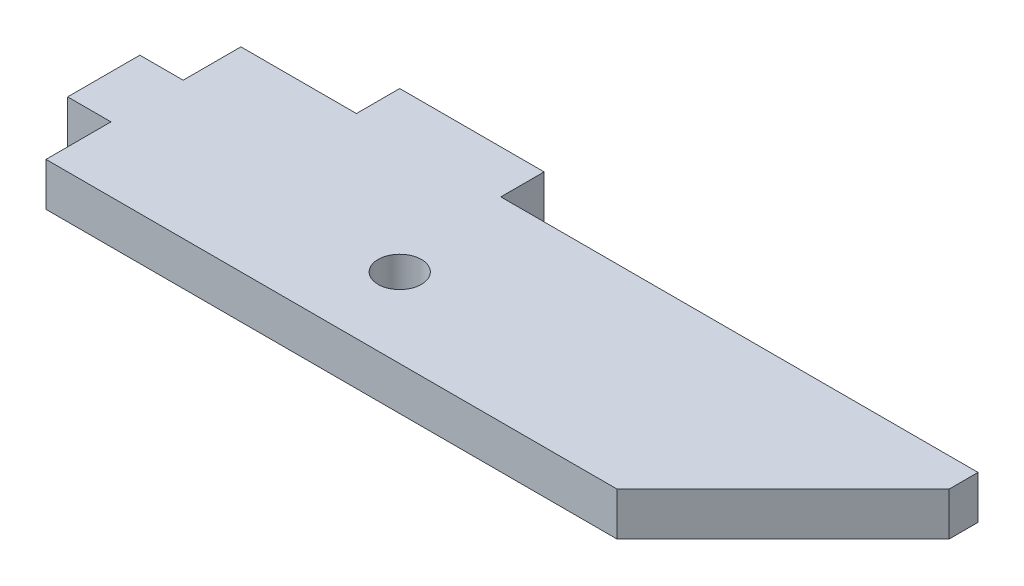
ISO-10303-21;
HEADER;
FILE_DESCRIPTION(('STEP AP214'),'2;1');
FILE_NAME('part.step','',(''),(''),'','','');
FILE_SCHEMA(('AUTOMOTIVE_DESIGN { 1 0 10303 214 1 1 1 1 }'));
ENDSEC;
DATA;
#1=APPLICATION_CONTEXT('core data for automotive mechanical design processes');
#2=APPLICATION_PROTOCOL_DEFINITION('international standard','automotive_design',2000,#1);
#3=PRODUCT_CONTEXT('',#1,'mechanical');
#4=PRODUCT('Part','Part','',(#3));
#5=PRODUCT_RELATED_PRODUCT_CATEGORY('part','',(#4));
#6=PRODUCT_DEFINITION_FORMATION('','',#4);
#7=PRODUCT_DEFINITION_CONTEXT('part definition',#1,'design');
#8=PRODUCT_DEFINITION('design','',#6,#7);
#9=PRODUCT_DEFINITION_SHAPE('','',#8);
#10=(LENGTH_UNIT() NAMED_UNIT(*) SI_UNIT(.MILLI.,.METRE.));
#11=(NAMED_UNIT(*) PLANE_ANGLE_UNIT() SI_UNIT($,.RADIAN.));
#12=(NAMED_UNIT(*) SI_UNIT($,.STERADIAN.) SOLID_ANGLE_UNIT());
#13=UNCERTAINTY_MEASURE_WITH_UNIT(LENGTH_MEASURE(1.E-05),#10,'distance_accuracy_value','');
#14=(GEOMETRIC_REPRESENTATION_CONTEXT(3) GLOBAL_UNCERTAINTY_ASSIGNED_CONTEXT((#13)) GLOBAL_UNIT_ASSIGNED_CONTEXT((#10,
#11,#12)) REPRESENTATION_CONTEXT('',''));
#15=CARTESIAN_POINT('',(0.,0.,0.));
#16=DIRECTION('',(0.,0.,1.));
#17=DIRECTION('',(1.,0.,0.));
#18=AXIS2_PLACEMENT_3D('',#15,#16,#17);
#19=CARTESIAN_POINT('',(0.,3.,0.));
#20=DIRECTION('',(0.,-1.,0.));
#21=DIRECTION('',(0.,0.,-1.));
#22=AXIS2_PLACEMENT_3D('',#19,#20,#21);
#23=PLANE('',#22);
#24=DIRECTION('',(0.,0.,1.));
#25=VECTOR('',#24,1.);
#26=CARTESIAN_POINT('',(-55.3800021183695,3.,9.08659696226554));
#27=LINE('',#26,#25);
#28=CARTESIAN_POINT('',(-55.3800021183695,3.,4.58659696226555));
#29=VERTEX_POINT('',#28);
#30=CARTESIAN_POINT('',(-55.3800021183695,3.,9.08659696226554));
#31=VERTEX_POINT('',#30);
#32=EDGE_CURVE('E184',#29,#31,#27,.T.);
#33=ORIENTED_EDGE('',*,*,#32,.T.);
#34=DIRECTION('',(1.,0.,0.));
#35=VECTOR('',#34,1.);
#36=CARTESIAN_POINT('',(-15.8200021183695,3.,9.08659696226553));
#37=LINE('',#36,#35);
#38=CARTESIAN_POINT('',(-15.8200021183695,3.,9.08659696226553));
#39=VERTEX_POINT('',#38);
#40=EDGE_CURVE('E107',#31,#39,#37,.T.);
#41=ORIENTED_EDGE('',*,*,#40,.T.);
#42=DIRECTION('',(0.707106781186546,0.,-0.707106781186549));
#43=VECTOR('',#42,1.);
#44=CARTESIAN_POINT('',(-4.33000211836955,3.,-2.4034030377345));
#45=LINE('',#44,#43);
#46=CARTESIAN_POINT('',(-4.33000211836955,3.,-2.4034030377345));
#47=VERTEX_POINT('',#46);
#48=EDGE_CURVE('E214',#39,#47,#45,.T.);
#49=ORIENTED_EDGE('',*,*,#48,.T.);
#50=DIRECTION('',(0.,0.,-1.));
#51=VECTOR('',#50,1.);
#52=CARTESIAN_POINT('',(-4.33000211836955,3.,-4.41340303773464));
#53=LINE('',#52,#51);
#54=CARTESIAN_POINT('',(-4.33000211836955,3.,-4.41340303773464));
#55=VERTEX_POINT('',#54);
#56=EDGE_CURVE('E233',#47,#55,#53,.T.);
#57=ORIENTED_EDGE('',*,*,#56,.T.);
#58=DIRECTION('',(-1.,0.,0.));
#59=VECTOR('',#58,1.);
#60=CARTESIAN_POINT('',(-37.3800021183695,3.,-4.41340303773446));
#61=LINE('',#60,#59);
#62=CARTESIAN_POINT('',(-37.3800021183695,3.,-4.41340303773446));
#63=VERTEX_POINT('',#62);
#64=EDGE_CURVE('E230',#55,#63,#61,.T.);
#65=ORIENTED_EDGE('',*,*,#64,.T.);
#66=DIRECTION('',(0.,0.,-1.));
#67=VECTOR('',#66,1.);
#68=CARTESIAN_POINT('',(-37.3800021183695,3.,-7.41340303773446));
#69=LINE('',#68,#67);
#70=CARTESIAN_POINT('',(-37.3800021183695,3.,-7.41340303773446));
#71=VERTEX_POINT('',#70);
#72=EDGE_CURVE('E232',#63,#71,#69,.T.);
#73=ORIENTED_EDGE('',*,*,#72,.T.);
#74=DIRECTION('',(-1.,0.,0.));
#75=VECTOR('',#74,1.);
#76=CARTESIAN_POINT('',(-47.3800021183695,3.,-7.41340303773446));
#77=LINE('',#76,#75);
#78=CARTESIAN_POINT('',(-47.3800021183695,3.,-7.41340303773446));
#79=VERTEX_POINT('',#78);
#80=EDGE_CURVE('E235',#71,#79,#77,.T.);
#81=ORIENTED_EDGE('',*,*,#80,.T.);
#82=DIRECTION('',(0.,0.,1.));
#83=VECTOR('',#82,1.);
#84=CARTESIAN_POINT('',(-47.3800021183695,3.,-7.41340303773446));
#85=LINE('',#84,#83);
#86=CARTESIAN_POINT('',(-47.3800021183695,3.,-4.41340303773446));
#87=VERTEX_POINT('',#86);
#88=EDGE_CURVE('E241',#79,#87,#85,.T.);
#89=ORIENTED_EDGE('',*,*,#88,.T.);
#90=DIRECTION('',(-1.,0.,0.));
#91=VECTOR('',#90,1.);
#92=CARTESIAN_POINT('',(-47.3800021183695,3.,-4.41340303773446));
#93=LINE('',#92,#91);
#94=CARTESIAN_POINT('',(-55.3800021183695,3.,-4.41340303773446));
#95=VERTEX_POINT('',#94);
#96=EDGE_CURVE('E243',#87,#95,#93,.T.);
#97=ORIENTED_EDGE('',*,*,#96,.T.);
#98=DIRECTION('',(0.,0.,1.));
#99=VECTOR('',#98,1.);
#100=CARTESIAN_POINT('',(-55.3800021183696,3.,-0.413403037734454));
#101=LINE('',#100,#99);
#102=CARTESIAN_POINT('',(-55.3800021183696,3.,-0.413403037734454));
#103=VERTEX_POINT('',#102);
#104=EDGE_CURVE('E141',#95,#103,#101,.T.);
#105=ORIENTED_EDGE('',*,*,#104,.T.);
#106=DIRECTION('',(-1.,0.,0.));
#107=VECTOR('',#106,1.);
#108=CARTESIAN_POINT('',(-55.3800021183696,3.,-0.413403037734454));
#109=LINE('',#108,#107);
#110=CARTESIAN_POINT('',(-58.3800021183695,3.,-0.413403037734454));
#111=VERTEX_POINT('',#110);
#112=EDGE_CURVE('E135',#103,#111,#109,.T.);
#113=ORIENTED_EDGE('',*,*,#112,.T.);
#114=DIRECTION('',(0.,0.,1.));
#115=VECTOR('',#114,1.);
#116=CARTESIAN_POINT('',(-58.3800021183695,3.,-0.413403037734454));
#117=LINE('',#116,#115);
#118=CARTESIAN_POINT('',(-58.3800021183696,3.,4.58659696226555));
#119=VERTEX_POINT('',#118);
#120=EDGE_CURVE('E139',#111,#119,#117,.T.);
#121=ORIENTED_EDGE('',*,*,#120,.T.);
#122=DIRECTION('',(1.,0.,0.));
#123=VECTOR('',#122,1.);
#124=CARTESIAN_POINT('',(-58.3800021183696,3.,4.58659696226555));
#125=LINE('',#124,#123);
#126=EDGE_CURVE('E49',#119,#29,#125,.T.);
#127=ORIENTED_EDGE('',*,*,#126,.T.);
#128=EDGE_LOOP('',(#33,#41,#49,#57,#65,#73,#81,#89,#97,#105,#113,#121,#127));
#129=FACE_BOUND('',#128,.T.);
#130=CARTESIAN_POINT('',(-36.3800021183695,3.,3.58659696226536));
#131=DIRECTION('',(0.,1.,0.));
#132=DIRECTION('',(0.,0.,1.));
#133=AXIS2_PLACEMENT_3D('',#130,#131,#132);
#134=CIRCLE('',#133,1.5);
#135=CARTESIAN_POINT('',(-36.3800021183695,3.,5.08659696226537));
#136=VERTEX_POINT('',#135);
#137=EDGE_CURVE('E163',#136,#136,#134,.T.);
#138=ORIENTED_EDGE('',*,*,#137,.F.);
#139=EDGE_LOOP('',(#138));
#140=FACE_BOUND('',#139,.T.);
#141=ADVANCED_FACE('F32',(#129,#140),#23,.F.);
#142=CARTESIAN_POINT('',(0.,0.,0.));
#143=DIRECTION('',(0.,-1.,0.));
#144=DIRECTION('',(0.,0.,-1.));
#145=AXIS2_PLACEMENT_3D('',#142,#143,#144);
#146=PLANE('',#145);
#147=DIRECTION('',(0.,0.,1.));
#148=VECTOR('',#147,1.);
#149=CARTESIAN_POINT('',(-55.3800021183695,0.,9.08659696226554));
#150=LINE('',#149,#148);
#151=CARTESIAN_POINT('',(-55.3800021183695,0.,4.58659696226555));
#152=VERTEX_POINT('',#151);
#153=CARTESIAN_POINT('',(-55.3800021183695,0.,9.08659696226554));
#154=VERTEX_POINT('',#153);
#155=EDGE_CURVE('E159',#152,#154,#150,.T.);
#156=ORIENTED_EDGE('',*,*,#155,.F.);
#157=DIRECTION('',(1.,0.,0.));
#158=VECTOR('',#157,1.);
#159=CARTESIAN_POINT('',(-58.3800021183696,0.,4.58659696226555));
#160=LINE('',#159,#158);
#161=CARTESIAN_POINT('',(-58.3800021183696,0.,4.58659696226555));
#162=VERTEX_POINT('',#161);
#163=EDGE_CURVE('E99',#162,#152,#160,.T.);
#164=ORIENTED_EDGE('',*,*,#163,.F.);
#165=DIRECTION('',(0.,0.,1.));
#166=VECTOR('',#165,1.);
#167=CARTESIAN_POINT('',(-58.3800021183695,0.,-0.413403037734454));
#168=LINE('',#167,#166);
#169=CARTESIAN_POINT('',(-58.3800021183695,0.,-0.413403037734454));
#170=VERTEX_POINT('',#169);
#171=EDGE_CURVE('E93',#170,#162,#168,.T.);
#172=ORIENTED_EDGE('',*,*,#171,.F.);
#173=DIRECTION('',(-1.,0.,0.));
#174=VECTOR('',#173,1.);
#175=CARTESIAN_POINT('',(-55.3800021183696,0.,-0.413403037734454));
#176=LINE('',#175,#174);
#177=CARTESIAN_POINT('',(-55.3800021183696,0.,-0.413403037734454));
#178=VERTEX_POINT('',#177);
#179=EDGE_CURVE('E149',#178,#170,#176,.T.);
#180=ORIENTED_EDGE('',*,*,#179,.F.);
#181=DIRECTION('',(0.,0.,1.));
#182=VECTOR('',#181,1.);
#183=CARTESIAN_POINT('',(-55.3800021183696,0.,-0.413403037734454));
#184=LINE('',#183,#182);
#185=CARTESIAN_POINT('',(-55.3800021183695,0.,-4.41340303773446));
#186=VERTEX_POINT('',#185);
#187=EDGE_CURVE('E179',#186,#178,#184,.T.);
#188=ORIENTED_EDGE('',*,*,#187,.F.);
#189=DIRECTION('',(-1.,0.,0.));
#190=VECTOR('',#189,1.);
#191=CARTESIAN_POINT('',(-47.3800021183695,0.,-4.41340303773446));
#192=LINE('',#191,#190);
#193=CARTESIAN_POINT('',(-47.3800021183695,0.,-4.41340303773446));
#194=VERTEX_POINT('',#193);
#195=EDGE_CURVE('E177',#194,#186,#192,.T.);
#196=ORIENTED_EDGE('',*,*,#195,.F.);
#197=DIRECTION('',(0.,0.,1.));
#198=VECTOR('',#197,1.);
#199=CARTESIAN_POINT('',(-47.3800021183695,0.,-7.41340303773446));
#200=LINE('',#199,#198);
#201=CARTESIAN_POINT('',(-47.3800021183695,0.,-7.41340303773446));
#202=VERTEX_POINT('',#201);
#203=EDGE_CURVE('E175',#202,#194,#200,.T.);
#204=ORIENTED_EDGE('',*,*,#203,.F.);
#205=DIRECTION('',(-1.,0.,0.));
#206=VECTOR('',#205,1.);
#207=CARTESIAN_POINT('',(-47.3800021183695,0.,-7.41340303773446));
#208=LINE('',#207,#206);
#209=CARTESIAN_POINT('',(-37.3800021183695,0.,-7.41340303773446));
#210=VERTEX_POINT('',#209);
#211=EDGE_CURVE('E173',#210,#202,#208,.T.);
#212=ORIENTED_EDGE('',*,*,#211,.F.);
#213=DIRECTION('',(0.,0.,-1.));
#214=VECTOR('',#213,1.);
#215=CARTESIAN_POINT('',(-37.3800021183695,0.,-7.41340303773446));
#216=LINE('',#215,#214);
#217=CARTESIAN_POINT('',(-37.3800021183695,0.,-4.41340303773446));
#218=VERTEX_POINT('',#217);
#219=EDGE_CURVE('E171',#218,#210,#216,.T.);
#220=ORIENTED_EDGE('',*,*,#219,.F.);
#221=DIRECTION('',(-1.,0.,0.));
#222=VECTOR('',#221,1.);
#223=CARTESIAN_POINT('',(-37.3800021183695,0.,-4.41340303773446));
#224=LINE('',#223,#222);
#225=CARTESIAN_POINT('',(-4.33000211836955,0.,-4.41340303773464));
#226=VERTEX_POINT('',#225);
#227=EDGE_CURVE('E169',#226,#218,#224,.T.);
#228=ORIENTED_EDGE('',*,*,#227,.F.);
#229=DIRECTION('',(0.,0.,-1.));
#230=VECTOR('',#229,1.);
#231=CARTESIAN_POINT('',(-4.33000211836955,0.,-4.41340303773464));
#232=LINE('',#231,#230);
#233=CARTESIAN_POINT('',(-4.33000211836955,0.,-2.4034030377345));
#234=VERTEX_POINT('',#233);
#235=EDGE_CURVE('E167',#234,#226,#232,.T.);
#236=ORIENTED_EDGE('',*,*,#235,.F.);
#237=DIRECTION('',(0.707106781186546,0.,-0.707106781186549));
#238=VECTOR('',#237,1.);
#239=CARTESIAN_POINT('',(-4.33000211836955,0.,-2.4034030377345));
#240=LINE('',#239,#238);
#241=CARTESIAN_POINT('',(-15.8200021183695,0.,9.08659696226553));
#242=VERTEX_POINT('',#241);
#243=EDGE_CURVE('E165',#242,#234,#240,.T.);
#244=ORIENTED_EDGE('',*,*,#243,.F.);
#245=DIRECTION('',(1.,0.,0.));
#246=VECTOR('',#245,1.);
#247=CARTESIAN_POINT('',(-15.8200021183695,0.,9.08659696226553));
#248=LINE('',#247,#246);
#249=EDGE_CURVE('E162',#154,#242,#248,.T.);
#250=ORIENTED_EDGE('',*,*,#249,.F.);
#251=EDGE_LOOP('',(#156,#164,#172,#180,#188,#196,#204,#212,#220,#228,#236,#244,#250));
#252=FACE_BOUND('',#251,.T.);
#253=CARTESIAN_POINT('',(-36.3800021183695,0.,3.58659696226536));
#254=DIRECTION('',(0.,1.,0.));
#255=DIRECTION('',(0.,0.,1.));
#256=AXIS2_PLACEMENT_3D('',#253,#254,#255);
#257=CIRCLE('',#256,1.5);
#258=CARTESIAN_POINT('',(-36.3800021183695,0.,5.08659696226537));
#259=VERTEX_POINT('',#258);
#260=EDGE_CURVE('E403',#259,#259,#257,.T.);
#261=ORIENTED_EDGE('',*,*,#260,.T.);
#262=EDGE_LOOP('',(#261));
#263=FACE_BOUND('',#262,.T.);
#264=ADVANCED_FACE('F218',(#252,#263),#146,.T.);
#265=CARTESIAN_POINT('',(-55.3800021183695,3.,9.08659696226554));
#266=DIRECTION('',(1.,0.,0.));
#267=DIRECTION('',(0.,0.,-1.));
#268=AXIS2_PLACEMENT_3D('',#265,#266,#267);
#269=PLANE('',#268);
#270=ORIENTED_EDGE('',*,*,#155,.T.);
#271=DIRECTION('',(0.,-1.,0.));
#272=VECTOR('',#271,1.);
#273=CARTESIAN_POINT('',(-55.3800021183695,3.,9.08659696226554));
#274=LINE('',#273,#272);
#275=EDGE_CURVE('E11',#31,#154,#274,.T.);
#276=ORIENTED_EDGE('',*,*,#275,.F.);
#277=ORIENTED_EDGE('',*,*,#32,.F.);
#278=DIRECTION('',(0.,-1.,0.));
#279=VECTOR('',#278,1.);
#280=CARTESIAN_POINT('',(-55.3800021183695,3.,4.58659696226555));
#281=LINE('',#280,#279);
#282=EDGE_CURVE('E155',#29,#152,#281,.T.);
#283=ORIENTED_EDGE('',*,*,#282,.T.);
#284=EDGE_LOOP('',(#270,#276,#277,#283));
#285=FACE_BOUND('',#284,.T.);
#286=ADVANCED_FACE('F34',(#285),#269,.F.);
#287=CARTESIAN_POINT('',(-15.8200021183695,3.,9.08659696226553));
#288=DIRECTION('',(0.,0.,-1.));
#289=DIRECTION('',(-1.,0.,0.));
#290=AXIS2_PLACEMENT_3D('',#287,#288,#289);
#291=PLANE('',#290);
#292=ORIENTED_EDGE('',*,*,#249,.T.);
#293=DIRECTION('',(0.,-1.,0.));
#294=VECTOR('',#293,1.);
#295=CARTESIAN_POINT('',(-15.8200021183695,3.,9.08659696226553));
#296=LINE('',#295,#294);
#297=EDGE_CURVE('E41',#39,#242,#296,.T.);
#298=ORIENTED_EDGE('',*,*,#297,.F.);
#299=ORIENTED_EDGE('',*,*,#40,.F.);
#300=ORIENTED_EDGE('',*,*,#275,.T.);
#301=EDGE_LOOP('',(#292,#298,#299,#300));
#302=FACE_BOUND('',#301,.T.);
#303=ADVANCED_FACE('F277',(#302),#291,.F.);
#304=CARTESIAN_POINT('',(-4.33000211836955,3.,-2.4034030377345));
#305=DIRECTION('',(-0.707106781186549,0.,-0.707106781186546));
#306=DIRECTION('',(-0.707106781186546,0.,0.707106781186549));
#307=AXIS2_PLACEMENT_3D('',#304,#305,#306);
#308=PLANE('',#307);
#309=ORIENTED_EDGE('',*,*,#243,.T.);
#310=DIRECTION('',(0.,-1.,0.));
#311=VECTOR('',#310,1.);
#312=CARTESIAN_POINT('',(-4.33000211836955,3.,-2.4034030377345));
#313=LINE('',#312,#311);
#314=EDGE_CURVE('E206',#47,#234,#313,.T.);
#315=ORIENTED_EDGE('',*,*,#314,.F.);
#316=ORIENTED_EDGE('',*,*,#48,.F.);
#317=ORIENTED_EDGE('',*,*,#297,.T.);
#318=EDGE_LOOP('',(#309,#315,#316,#317));
#319=FACE_BOUND('',#318,.T.);
#320=ADVANCED_FACE('F212',(#319),#308,.F.);
#321=CARTESIAN_POINT('',(-4.33000211836955,3.,-4.41340303773464));
#322=DIRECTION('',(-1.,0.,0.));
#323=DIRECTION('',(0.,0.,1.));
#324=AXIS2_PLACEMENT_3D('',#321,#322,#323);
#325=PLANE('',#324);
#326=ORIENTED_EDGE('',*,*,#235,.T.);
#327=DIRECTION('',(0.,-1.,0.));
#328=VECTOR('',#327,1.);
#329=CARTESIAN_POINT('',(-4.33000211836955,3.,-4.41340303773464));
#330=LINE('',#329,#328);
#331=EDGE_CURVE('E203',#55,#226,#330,.T.);
#332=ORIENTED_EDGE('',*,*,#331,.F.);
#333=ORIENTED_EDGE('',*,*,#56,.F.);
#334=ORIENTED_EDGE('',*,*,#314,.T.);
#335=EDGE_LOOP('',(#326,#332,#333,#334));
#336=FACE_BOUND('',#335,.T.);
#337=ADVANCED_FACE('F224',(#336),#325,.F.);
#338=CARTESIAN_POINT('',(-37.3800021183695,3.,-4.41340303773446));
#339=DIRECTION('',(0.,0.,1.));
#340=DIRECTION('',(1.,0.,0.));
#341=AXIS2_PLACEMENT_3D('',#338,#339,#340);
#342=PLANE('',#341);
#343=ORIENTED_EDGE('',*,*,#227,.T.);
#344=DIRECTION('',(0.,-1.,0.));
#345=VECTOR('',#344,1.);
#346=CARTESIAN_POINT('',(-37.3800021183695,3.,-4.41340303773446));
#347=LINE('',#346,#345);
#348=EDGE_CURVE('E200',#63,#218,#347,.T.);
#349=ORIENTED_EDGE('',*,*,#348,.F.);
#350=ORIENTED_EDGE('',*,*,#64,.F.);
#351=ORIENTED_EDGE('',*,*,#331,.T.);
#352=EDGE_LOOP('',(#343,#349,#350,#351));
#353=FACE_BOUND('',#352,.T.);
#354=ADVANCED_FACE('F228',(#353),#342,.F.);
#355=CARTESIAN_POINT('',(-37.3800021183695,3.,-7.41340303773446));
#356=DIRECTION('',(-1.,0.,0.));
#357=DIRECTION('',(0.,0.,1.));
#358=AXIS2_PLACEMENT_3D('',#355,#356,#357);
#359=PLANE('',#358);
#360=ORIENTED_EDGE('',*,*,#219,.T.);
#361=DIRECTION('',(0.,-1.,0.));
#362=VECTOR('',#361,1.);
#363=CARTESIAN_POINT('',(-37.3800021183695,3.,-7.41340303773446));
#364=LINE('',#363,#362);
#365=EDGE_CURVE('E197',#71,#210,#364,.T.);
#366=ORIENTED_EDGE('',*,*,#365,.F.);
#367=ORIENTED_EDGE('',*,*,#72,.F.);
#368=ORIENTED_EDGE('',*,*,#348,.T.);
#369=EDGE_LOOP('',(#360,#366,#367,#368));
#370=FACE_BOUND('',#369,.T.);
#371=ADVANCED_FACE('F290',(#370),#359,.F.);
#372=CARTESIAN_POINT('',(-47.3800021183695,3.,-7.41340303773446));
#373=DIRECTION('',(0.,0.,1.));
#374=DIRECTION('',(1.,0.,0.));
#375=AXIS2_PLACEMENT_3D('',#372,#373,#374);
#376=PLANE('',#375);
#377=ORIENTED_EDGE('',*,*,#211,.T.);
#378=DIRECTION('',(0.,-1.,0.));
#379=VECTOR('',#378,1.);
#380=CARTESIAN_POINT('',(-47.3800021183695,3.,-7.41340303773446));
#381=LINE('',#380,#379);
#382=EDGE_CURVE('E194',#79,#202,#381,.T.);
#383=ORIENTED_EDGE('',*,*,#382,.F.);
#384=ORIENTED_EDGE('',*,*,#80,.F.);
#385=ORIENTED_EDGE('',*,*,#365,.T.);
#386=EDGE_LOOP('',(#377,#383,#384,#385));
#387=FACE_BOUND('',#386,.T.);
#388=ADVANCED_FACE('F293',(#387),#376,.F.);
#389=CARTESIAN_POINT('',(-47.3800021183695,3.,-7.41340303773446));
#390=DIRECTION('',(1.,0.,0.));
#391=DIRECTION('',(0.,0.,-1.));
#392=AXIS2_PLACEMENT_3D('',#389,#390,#391);
#393=PLANE('',#392);
#394=ORIENTED_EDGE('',*,*,#203,.T.);
#395=DIRECTION('',(0.,-1.,0.));
#396=VECTOR('',#395,1.);
#397=CARTESIAN_POINT('',(-47.3800021183695,3.,-4.41340303773446));
#398=LINE('',#397,#396);
#399=EDGE_CURVE('E191',#87,#194,#398,.T.);
#400=ORIENTED_EDGE('',*,*,#399,.F.);
#401=ORIENTED_EDGE('',*,*,#88,.F.);
#402=ORIENTED_EDGE('',*,*,#382,.T.);
#403=EDGE_LOOP('',(#394,#400,#401,#402));
#404=FACE_BOUND('',#403,.T.);
#405=ADVANCED_FACE('F297',(#404),#393,.F.);
#406=CARTESIAN_POINT('',(-47.3800021183695,3.,-4.41340303773446));
#407=DIRECTION('',(0.,0.,1.));
#408=DIRECTION('',(1.,0.,0.));
#409=AXIS2_PLACEMENT_3D('',#406,#407,#408);
#410=PLANE('',#409);
#411=ORIENTED_EDGE('',*,*,#195,.T.);
#412=DIRECTION('',(0.,-1.,0.));
#413=VECTOR('',#412,1.);
#414=CARTESIAN_POINT('',(-55.3800021183695,3.,-4.41340303773446));
#415=LINE('',#414,#413);
#416=EDGE_CURVE('E188',#95,#186,#415,.T.);
#417=ORIENTED_EDGE('',*,*,#416,.F.);
#418=ORIENTED_EDGE('',*,*,#96,.F.);
#419=ORIENTED_EDGE('',*,*,#399,.T.);
#420=EDGE_LOOP('',(#411,#417,#418,#419));
#421=FACE_BOUND('',#420,.T.);
#422=ADVANCED_FACE('F249',(#421),#410,.F.);
#423=CARTESIAN_POINT('',(-55.3800021183696,3.,-0.413403037734454));
#424=DIRECTION('',(1.,0.,0.));
#425=DIRECTION('',(0.,0.,-1.));
#426=AXIS2_PLACEMENT_3D('',#423,#424,#425);
#427=PLANE('',#426);
#428=ORIENTED_EDGE('',*,*,#187,.T.);
#429=DIRECTION('',(0.,-1.,0.));
#430=VECTOR('',#429,1.);
#431=CARTESIAN_POINT('',(-55.3800021183696,3.,-0.413403037734454));
#432=LINE('',#431,#430);
#433=EDGE_CURVE('E150',#103,#178,#432,.T.);
#434=ORIENTED_EDGE('',*,*,#433,.F.);
#435=ORIENTED_EDGE('',*,*,#104,.F.);
#436=ORIENTED_EDGE('',*,*,#416,.T.);
#437=EDGE_LOOP('',(#428,#434,#435,#436));
#438=FACE_BOUND('',#437,.T.);
#439=ADVANCED_FACE('F253',(#438),#427,.F.);
#440=CARTESIAN_POINT('',(-55.3800021183696,3.,-0.413403037734454));
#441=DIRECTION('',(0.,0.,1.));
#442=DIRECTION('',(1.,0.,0.));
#443=AXIS2_PLACEMENT_3D('',#440,#441,#442);
#444=PLANE('',#443);
#445=ORIENTED_EDGE('',*,*,#179,.T.);
#446=DIRECTION('',(0.,-1.,0.));
#447=VECTOR('',#446,1.);
#448=CARTESIAN_POINT('',(-58.3800021183695,3.,-0.413403037734454));
#449=LINE('',#448,#447);
#450=EDGE_CURVE('E146',#111,#170,#449,.T.);
#451=ORIENTED_EDGE('',*,*,#450,.F.);
#452=ORIENTED_EDGE('',*,*,#112,.F.);
#453=ORIENTED_EDGE('',*,*,#433,.T.);
#454=EDGE_LOOP('',(#445,#451,#452,#453));
#455=FACE_BOUND('',#454,.T.);
#456=ADVANCED_FACE('F147',(#455),#444,.F.);
#457=CARTESIAN_POINT('',(-58.3800021183695,3.,-0.413403037734454));
#458=DIRECTION('',(1.,0.,0.));
#459=DIRECTION('',(0.,0.,-1.));
#460=AXIS2_PLACEMENT_3D('',#457,#458,#459);
#461=PLANE('',#460);
#462=ORIENTED_EDGE('',*,*,#171,.T.);
#463=DIRECTION('',(0.,-1.,0.));
#464=VECTOR('',#463,1.);
#465=CARTESIAN_POINT('',(-58.3800021183696,3.,4.58659696226555));
#466=LINE('',#465,#464);
#467=EDGE_CURVE('E151',#119,#162,#466,.T.);
#468=ORIENTED_EDGE('',*,*,#467,.F.);
#469=ORIENTED_EDGE('',*,*,#120,.F.);
#470=ORIENTED_EDGE('',*,*,#450,.T.);
#471=EDGE_LOOP('',(#462,#468,#469,#470));
#472=FACE_BOUND('',#471,.T.);
#473=ADVANCED_FACE('F153',(#472),#461,.F.);
#474=CARTESIAN_POINT('',(-58.3800021183696,3.,4.58659696226555));
#475=DIRECTION('',(0.,0.,-1.));
#476=DIRECTION('',(-1.,0.,0.));
#477=AXIS2_PLACEMENT_3D('',#474,#475,#476);
#478=PLANE('',#477);
#479=ORIENTED_EDGE('',*,*,#163,.T.);
#480=ORIENTED_EDGE('',*,*,#282,.F.);
#481=ORIENTED_EDGE('',*,*,#126,.F.);
#482=ORIENTED_EDGE('',*,*,#467,.T.);
#483=EDGE_LOOP('',(#479,#480,#481,#482));
#484=FACE_BOUND('',#483,.T.);
#485=ADVANCED_FACE('F257',(#484),#478,.F.);
#486=CARTESIAN_POINT('',(-36.3800021183695,3.,3.58659696226536));
#487=DIRECTION('',(0.,-1.,0.));
#488=DIRECTION('',(0.,0.,-1.));
#489=AXIS2_PLACEMENT_3D('',#486,#487,#488);
#490=CYLINDRICAL_SURFACE('',#489,1.5);
#491=ORIENTED_EDGE('',*,*,#137,.T.);
#492=EDGE_LOOP('',(#491));
#493=FACE_BOUND('',#492,.T.);
#494=ORIENTED_EDGE('',*,*,#260,.F.);
#495=EDGE_LOOP('',(#494));
#496=FACE_BOUND('',#495,.T.);
#497=ADVANCED_FACE('F259',(#493,#496),#490,.F.);
#498=CLOSED_SHELL('',(#141,#264,#286,#303,#320,#337,#354,#371,#388,#405,#422,#439,#456,#473,
#485,#497));
#499=MANIFOLD_SOLID_BREP('B2',#498);
#500=ADVANCED_BREP_SHAPE_REPRESENTATION('',(#18,#499),#14);
#501=SHAPE_DEFINITION_REPRESENTATION(#9,#500);
ENDSEC;
END-ISO-10303-21;
